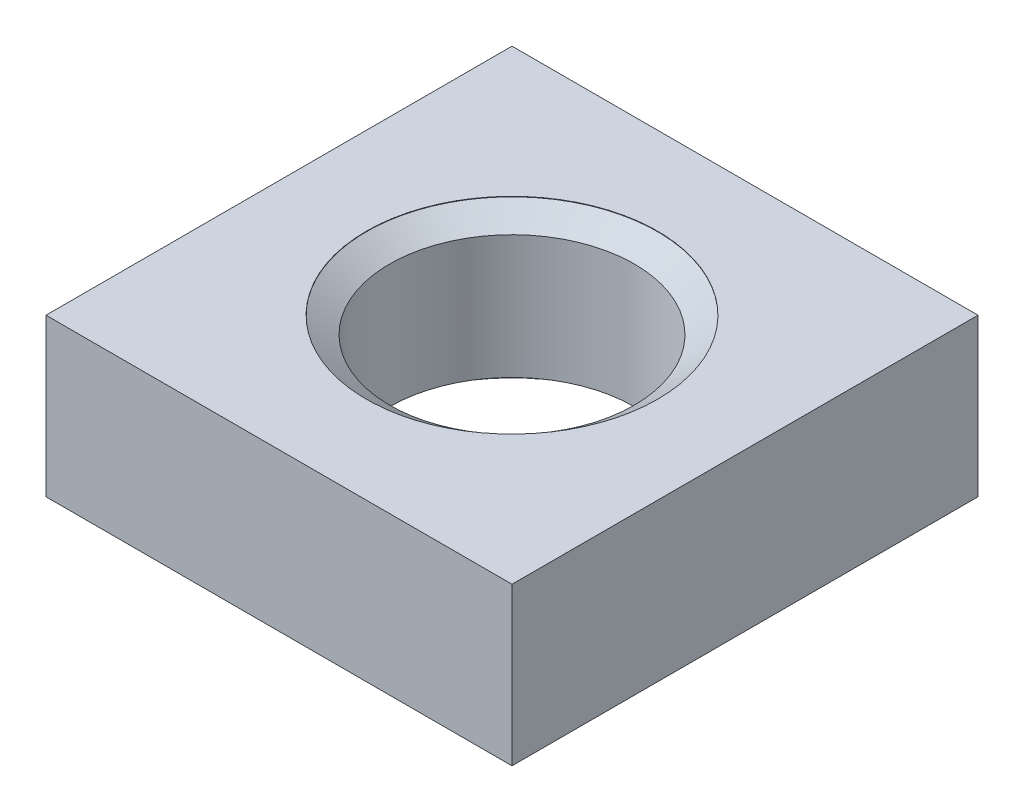
ISO-10303-21;
HEADER;
FILE_DESCRIPTION(('STEP AP214'),'2;1');
FILE_NAME('part.step','',(''),(''),'','','');
FILE_SCHEMA(('AUTOMOTIVE_DESIGN { 1 0 10303 214 1 1 1 1 }'));
ENDSEC;
DATA;
#1=APPLICATION_CONTEXT('core data for automotive mechanical design processes');
#2=APPLICATION_PROTOCOL_DEFINITION('international standard','automotive_design',2000,#1);
#3=PRODUCT_CONTEXT('',#1,'mechanical');
#4=PRODUCT('Part','Part','',(#3));
#5=PRODUCT_RELATED_PRODUCT_CATEGORY('part','',(#4));
#6=PRODUCT_DEFINITION_FORMATION('','',#4);
#7=PRODUCT_DEFINITION_CONTEXT('part definition',#1,'design');
#8=PRODUCT_DEFINITION('design','',#6,#7);
#9=PRODUCT_DEFINITION_SHAPE('','',#8);
#10=(LENGTH_UNIT() NAMED_UNIT(*) SI_UNIT(.MILLI.,.METRE.));
#11=(NAMED_UNIT(*) PLANE_ANGLE_UNIT() SI_UNIT($,.RADIAN.));
#12=(NAMED_UNIT(*) SI_UNIT($,.STERADIAN.) SOLID_ANGLE_UNIT());
#13=UNCERTAINTY_MEASURE_WITH_UNIT(LENGTH_MEASURE(1.E-05),#10,'distance_accuracy_value','');
#14=(GEOMETRIC_REPRESENTATION_CONTEXT(3) GLOBAL_UNCERTAINTY_ASSIGNED_CONTEXT((#13)) GLOBAL_UNIT_ASSIGNED_CONTEXT((#10,
#11,#12)) REPRESENTATION_CONTEXT('',''));
#15=CARTESIAN_POINT('',(0.,0.,0.));
#16=DIRECTION('',(0.,0.,1.));
#17=DIRECTION('',(1.,0.,0.));
#18=AXIS2_PLACEMENT_3D('',#15,#16,#17);
#19=CARTESIAN_POINT('',(0.,-2.7,0.));
#20=DIRECTION('',(0.,1.,0.));
#21=DIRECTION('',(1.,0.,0.));
#22=AXIS2_PLACEMENT_3D('',#19,#20,#21);
#23=CYLINDRICAL_SURFACE('',#22,2.1);
#24=CARTESIAN_POINT('',(0.,-0.288083015283884,0.));
#25=DIRECTION('',(0.,1.,0.));
#26=DIRECTION('',(1.,0.,0.));
#27=AXIS2_PLACEMENT_3D('',#24,#25,#26);
#28=CIRCLE('',#27,2.1);
#29=CARTESIAN_POINT('',(2.1,-0.288083015283884,0.));
#30=VERTEX_POINT('',#29);
#31=EDGE_CURVE('E94',#30,#30,#28,.F.);
#32=ORIENTED_EDGE('',*,*,#31,.F.);
#33=EDGE_LOOP('',(#32));
#34=FACE_BOUND('',#33,.T.);
#35=CARTESIAN_POINT('',(0.,-2.41091698471612,0.));
#36=DIRECTION('',(0.,-1.,0.));
#37=DIRECTION('',(-1.,0.,0.));
#38=AXIS2_PLACEMENT_3D('',#35,#36,#37);
#39=CIRCLE('',#38,2.1);
#40=CARTESIAN_POINT('',(-2.1,-2.41091698471612,0.));
#41=VERTEX_POINT('',#40);
#42=EDGE_CURVE('E19',#41,#41,#39,.F.);
#43=ORIENTED_EDGE('',*,*,#42,.F.);
#44=EDGE_LOOP('',(#43));
#45=FACE_BOUND('',#44,.T.);
#46=ADVANCED_FACE('F15',(#34,#45),#23,.F.);
#47=CARTESIAN_POINT('',(-4.,-2.7,4.));
#48=DIRECTION('',(-1.,0.,0.));
#49=DIRECTION('',(0.,1.,0.));
#50=AXIS2_PLACEMENT_3D('',#47,#48,#49);
#51=PLANE('',#50);
#52=DIRECTION('',(0.,0.,1.));
#53=VECTOR('',#52,1.);
#54=CARTESIAN_POINT('',(-4.,0.,4.));
#55=LINE('',#54,#53);
#56=CARTESIAN_POINT('',(-4.,0.,-4.));
#57=VERTEX_POINT('',#56);
#58=CARTESIAN_POINT('',(-4.,0.,4.));
#59=VERTEX_POINT('',#58);
#60=EDGE_CURVE('E83',#57,#59,#55,.T.);
#61=ORIENTED_EDGE('',*,*,#60,.F.);
#62=DIRECTION('',(0.,1.,0.));
#63=VECTOR('',#62,1.);
#64=CARTESIAN_POINT('',(-4.,-2.7,-4.));
#65=LINE('',#64,#63);
#66=CARTESIAN_POINT('',(-4.,-2.7,-4.));
#67=VERTEX_POINT('',#66);
#68=EDGE_CURVE('E9',#67,#57,#65,.T.);
#69=ORIENTED_EDGE('',*,*,#68,.F.);
#70=DIRECTION('',(0.,0.,1.));
#71=VECTOR('',#70,1.);
#72=CARTESIAN_POINT('',(-4.,-2.7,4.));
#73=LINE('',#72,#71);
#74=CARTESIAN_POINT('',(-4.,-2.7,4.));
#75=VERTEX_POINT('',#74);
#76=EDGE_CURVE('E76',#67,#75,#73,.T.);
#77=ORIENTED_EDGE('',*,*,#76,.T.);
#78=DIRECTION('',(0.,1.,0.));
#79=VECTOR('',#78,1.);
#80=CARTESIAN_POINT('',(-4.,-2.7,4.));
#81=LINE('',#80,#79);
#82=EDGE_CURVE('E59',#75,#59,#81,.T.);
#83=ORIENTED_EDGE('',*,*,#82,.T.);
#84=EDGE_LOOP('',(#61,#69,#77,#83));
#85=FACE_BOUND('',#84,.T.);
#86=ADVANCED_FACE('F17',(#85),#51,.T.);
#87=CARTESIAN_POINT('',(-4.,-2.7,-4.));
#88=DIRECTION('',(0.,0.,-1.));
#89=DIRECTION('',(0.,1.,0.));
#90=AXIS2_PLACEMENT_3D('',#87,#88,#89);
#91=PLANE('',#90);
#92=DIRECTION('',(-1.,0.,0.));
#93=VECTOR('',#92,1.);
#94=CARTESIAN_POINT('',(-4.,0.,-4.));
#95=LINE('',#94,#93);
#96=CARTESIAN_POINT('',(4.,0.,-4.));
#97=VERTEX_POINT('',#96);
#98=EDGE_CURVE('E78',#97,#57,#95,.T.);
#99=ORIENTED_EDGE('',*,*,#98,.F.);
#100=DIRECTION('',(0.,1.,0.));
#101=VECTOR('',#100,1.);
#102=CARTESIAN_POINT('',(4.,-2.7,-4.));
#103=LINE('',#102,#101);
#104=CARTESIAN_POINT('',(4.,-2.7,-4.));
#105=VERTEX_POINT('',#104);
#106=EDGE_CURVE('E25',#105,#97,#103,.T.);
#107=ORIENTED_EDGE('',*,*,#106,.F.);
#108=DIRECTION('',(-1.,0.,0.));
#109=VECTOR('',#108,1.);
#110=CARTESIAN_POINT('',(-4.,-2.7,-4.));
#111=LINE('',#110,#109);
#112=EDGE_CURVE('E73',#105,#67,#111,.T.);
#113=ORIENTED_EDGE('',*,*,#112,.T.);
#114=ORIENTED_EDGE('',*,*,#68,.T.);
#115=EDGE_LOOP('',(#99,#107,#113,#114));
#116=FACE_BOUND('',#115,.T.);
#117=ADVANCED_FACE('F125',(#116),#91,.T.);
#118=CARTESIAN_POINT('',(4.,-2.7,4.));
#119=DIRECTION('',(1.,0.,0.));
#120=DIRECTION('',(0.,-1.,0.));
#121=AXIS2_PLACEMENT_3D('',#118,#119,#120);
#122=PLANE('',#121);
#123=DIRECTION('',(0.,0.,-1.));
#124=VECTOR('',#123,1.);
#125=CARTESIAN_POINT('',(4.,0.,4.));
#126=LINE('',#125,#124);
#127=CARTESIAN_POINT('',(4.,0.,4.));
#128=VERTEX_POINT('',#127);
#129=EDGE_CURVE('E67',#128,#97,#126,.T.);
#130=ORIENTED_EDGE('',*,*,#129,.F.);
#131=DIRECTION('',(0.,1.,0.));
#132=VECTOR('',#131,1.);
#133=CARTESIAN_POINT('',(4.,-2.7,4.));
#134=LINE('',#133,#132);
#135=CARTESIAN_POINT('',(4.,-2.7,4.));
#136=VERTEX_POINT('',#135);
#137=EDGE_CURVE('E62',#136,#128,#134,.T.);
#138=ORIENTED_EDGE('',*,*,#137,.F.);
#139=DIRECTION('',(0.,0.,-1.));
#140=VECTOR('',#139,1.);
#141=CARTESIAN_POINT('',(4.,-2.7,4.));
#142=LINE('',#141,#140);
#143=EDGE_CURVE('E65',#136,#105,#142,.T.);
#144=ORIENTED_EDGE('',*,*,#143,.T.);
#145=ORIENTED_EDGE('',*,*,#106,.T.);
#146=EDGE_LOOP('',(#130,#138,#144,#145));
#147=FACE_BOUND('',#146,.T.);
#148=ADVANCED_FACE('F64',(#147),#122,.T.);
#149=CARTESIAN_POINT('',(-4.,-2.7,4.));
#150=DIRECTION('',(0.,0.,1.));
#151=DIRECTION('',(0.,-1.,0.));
#152=AXIS2_PLACEMENT_3D('',#149,#150,#151);
#153=PLANE('',#152);
#154=DIRECTION('',(1.,0.,0.));
#155=VECTOR('',#154,1.);
#156=CARTESIAN_POINT('',(-4.,0.,4.));
#157=LINE('',#156,#155);
#158=EDGE_CURVE('E86',#59,#128,#157,.T.);
#159=ORIENTED_EDGE('',*,*,#158,.F.);
#160=ORIENTED_EDGE('',*,*,#82,.F.);
#161=DIRECTION('',(1.,0.,0.));
#162=VECTOR('',#161,1.);
#163=CARTESIAN_POINT('',(-4.,-2.7,4.));
#164=LINE('',#163,#162);
#165=EDGE_CURVE('E72',#75,#136,#164,.T.);
#166=ORIENTED_EDGE('',*,*,#165,.T.);
#167=ORIENTED_EDGE('',*,*,#137,.T.);
#168=EDGE_LOOP('',(#159,#160,#166,#167));
#169=FACE_BOUND('',#168,.T.);
#170=ADVANCED_FACE('F75',(#169),#153,.T.);
#171=CARTESIAN_POINT('',(-4.,-2.7,-4.));
#172=DIRECTION('',(0.,-1.,0.));
#173=DIRECTION('',(-1.,0.,0.));
#174=AXIS2_PLACEMENT_3D('',#171,#172,#173);
#175=PLANE('',#174);
#176=CARTESIAN_POINT('',(0.,-2.7,0.));
#177=DIRECTION('',(0.,-1.,0.));
#178=DIRECTION('',(-1.,0.,0.));
#179=AXIS2_PLACEMENT_3D('',#176,#177,#178);
#180=CIRCLE('',#179,2.5);
#181=CARTESIAN_POINT('',(-2.5,-2.7,0.));
#182=VERTEX_POINT('',#181);
#183=EDGE_CURVE('E99',#182,#182,#180,.F.);
#184=ORIENTED_EDGE('',*,*,#183,.T.);
#185=EDGE_LOOP('',(#184));
#186=FACE_BOUND('',#185,.T.);
#187=ORIENTED_EDGE('',*,*,#76,.F.);
#188=ORIENTED_EDGE('',*,*,#112,.F.);
#189=ORIENTED_EDGE('',*,*,#143,.F.);
#190=ORIENTED_EDGE('',*,*,#165,.F.);
#191=EDGE_LOOP('',(#187,#188,#189,#190));
#192=FACE_BOUND('',#191,.T.);
#193=ADVANCED_FACE('F71',(#186,#192),#175,.T.);
#194=CARTESIAN_POINT('',(-4.,0.,-4.));
#195=DIRECTION('',(0.,-1.,0.));
#196=DIRECTION('',(-1.,0.,0.));
#197=AXIS2_PLACEMENT_3D('',#194,#195,#196);
#198=PLANE('',#197);
#199=CARTESIAN_POINT('',(0.,0.,0.));
#200=DIRECTION('',(0.,-1.,0.));
#201=DIRECTION('',(-1.,0.,0.));
#202=AXIS2_PLACEMENT_3D('',#199,#200,#201);
#203=CIRCLE('',#202,2.5);
#204=CARTESIAN_POINT('',(-2.5,0.,0.));
#205=VERTEX_POINT('',#204);
#206=EDGE_CURVE('E87',#205,#205,#203,.F.);
#207=ORIENTED_EDGE('',*,*,#206,.F.);
#208=EDGE_LOOP('',(#207));
#209=FACE_BOUND('',#208,.T.);
#210=ORIENTED_EDGE('',*,*,#60,.T.);
#211=ORIENTED_EDGE('',*,*,#158,.T.);
#212=ORIENTED_EDGE('',*,*,#129,.T.);
#213=ORIENTED_EDGE('',*,*,#98,.T.);
#214=EDGE_LOOP('',(#210,#211,#212,#213));
#215=FACE_BOUND('',#214,.T.);
#216=ADVANCED_FACE('F118',(#209,#215),#198,.F.);
#217=CARTESIAN_POINT('',(0.,-25.0375057290932,0.));
#218=DIRECTION('',(0.,1.,0.));
#219=DIRECTION('',(1.,0.,0.));
#220=AXIS2_PLACEMENT_3D('',#217,#218,#219);
#221=CYLINDRICAL_SURFACE('',#220,2.5);
#222=CARTESIAN_POINT('',(0.,-0.00800000000000106,0.));
#223=DIRECTION('',(0.,1.,0.));
#224=DIRECTION('',(1.,0.,0.));
#225=AXIS2_PLACEMENT_3D('',#222,#223,#224);
#226=CIRCLE('',#225,2.5);
#227=CARTESIAN_POINT('',(2.5,-0.0080000000000012,0.));
#228=VERTEX_POINT('',#227);
#229=EDGE_CURVE('E97',#228,#228,#226,.T.);
#230=ORIENTED_EDGE('',*,*,#229,.F.);
#231=EDGE_LOOP('',(#230));
#232=FACE_BOUND('',#231,.T.);
#233=ORIENTED_EDGE('',*,*,#206,.T.);
#234=EDGE_LOOP('',(#233));
#235=FACE_BOUND('',#234,.T.);
#236=ADVANCED_FACE('F115',(#232,#235),#221,.F.);
#237=CARTESIAN_POINT('',(0.,-0.316091316812272,0.));
#238=DIRECTION('',(0.,1.,0.));
#239=DIRECTION('',(1.,0.,0.));
#240=AXIS2_PLACEMENT_3D('',#237,#238,#239);
#241=CONICAL_SURFACE('',#240,2.06,0.959931088596882);
#242=ORIENTED_EDGE('',*,*,#229,.T.);
#243=EDGE_LOOP('',(#242));
#244=FACE_BOUND('',#243,.T.);
#245=ORIENTED_EDGE('',*,*,#31,.T.);
#246=EDGE_LOOP('',(#245));
#247=FACE_BOUND('',#246,.T.);
#248=ADVANCED_FACE('F112',(#244,#247),#241,.F.);
#249=CARTESIAN_POINT('',(0.,-2.691,0.));
#250=DIRECTION('',(0.,-1.,0.));
#251=DIRECTION('',(-1.,0.,0.));
#252=AXIS2_PLACEMENT_3D('',#249,#250,#251);
#253=CONICAL_SURFACE('',#252,2.5,0.959931088596883);
#254=CARTESIAN_POINT('',(0.,-2.691,0.));
#255=DIRECTION('',(0.,1.,0.));
#256=DIRECTION('',(1.,0.,0.));
#257=AXIS2_PLACEMENT_3D('',#254,#255,#256);
#258=CIRCLE('',#257,2.5);
#259=CARTESIAN_POINT('',(2.5,-2.691,0.));
#260=VERTEX_POINT('',#259);
#261=EDGE_CURVE('E101',#260,#260,#258,.T.);
#262=ORIENTED_EDGE('',*,*,#261,.F.);
#263=EDGE_LOOP('',(#262));
#264=FACE_BOUND('',#263,.T.);
#265=ORIENTED_EDGE('',*,*,#42,.T.);
#266=EDGE_LOOP('',(#265));
#267=FACE_BOUND('',#266,.T.);
#268=ADVANCED_FACE('F204',(#264,#267),#253,.F.);
#269=CARTESIAN_POINT('',(0.,-25.0375057290932,0.));
#270=DIRECTION('',(0.,1.,0.));
#271=DIRECTION('',(1.,0.,0.));
#272=AXIS2_PLACEMENT_3D('',#269,#270,#271);
#273=CYLINDRICAL_SURFACE('',#272,2.5);
#274=ORIENTED_EDGE('',*,*,#183,.F.);
#275=EDGE_LOOP('',(#274));
#276=FACE_BOUND('',#275,.T.);
#277=ORIENTED_EDGE('',*,*,#261,.T.);
#278=EDGE_LOOP('',(#277));
#279=FACE_BOUND('',#278,.T.);
#280=ADVANCED_FACE('F211',(#276,#279),#273,.F.);
#281=CLOSED_SHELL('',(#46,#86,#117,#148,#170,#193,#216,#236,#248,#268,#280));
#282=MANIFOLD_SOLID_BREP('B1',#281);
#283=ADVANCED_BREP_SHAPE_REPRESENTATION('',(#18,#282),#14);
#284=SHAPE_DEFINITION_REPRESENTATION(#9,#283);
ENDSEC;
END-ISO-10303-21;
